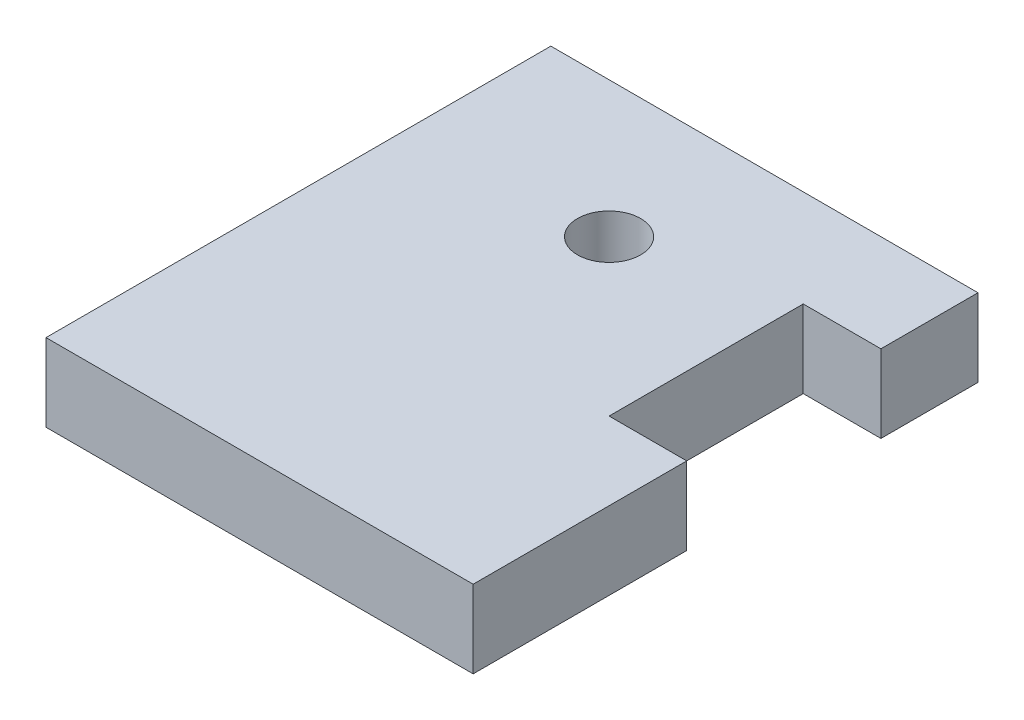
ISO-10303-21;
HEADER;
FILE_DESCRIPTION(('STEP AP214'),'2;1');
FILE_NAME('part.step','',(''),(''),'','','');
FILE_SCHEMA(('AUTOMOTIVE_DESIGN { 1 0 10303 214 1 1 1 1 }'));
ENDSEC;
DATA;
#1=APPLICATION_CONTEXT('core data for automotive mechanical design processes');
#2=APPLICATION_PROTOCOL_DEFINITION('international standard','automotive_design',2000,#1);
#3=PRODUCT_CONTEXT('',#1,'mechanical');
#4=PRODUCT('Part','Part','',(#3));
#5=PRODUCT_RELATED_PRODUCT_CATEGORY('part','',(#4));
#6=PRODUCT_DEFINITION_FORMATION('','',#4);
#7=PRODUCT_DEFINITION_CONTEXT('part definition',#1,'design');
#8=PRODUCT_DEFINITION('design','',#6,#7);
#9=PRODUCT_DEFINITION_SHAPE('','',#8);
#10=(LENGTH_UNIT() NAMED_UNIT(*) SI_UNIT(.MILLI.,.METRE.));
#11=(NAMED_UNIT(*) PLANE_ANGLE_UNIT() SI_UNIT($,.RADIAN.));
#12=(NAMED_UNIT(*) SI_UNIT($,.STERADIAN.) SOLID_ANGLE_UNIT());
#13=UNCERTAINTY_MEASURE_WITH_UNIT(LENGTH_MEASURE(1.E-05),#10,'distance_accuracy_value','');
#14=(GEOMETRIC_REPRESENTATION_CONTEXT(3) GLOBAL_UNCERTAINTY_ASSIGNED_CONTEXT((#13)) GLOBAL_UNIT_ASSIGNED_CONTEXT((#10,
#11,#12)) REPRESENTATION_CONTEXT('',''));
#15=CARTESIAN_POINT('',(0.,0.,0.));
#16=DIRECTION('',(0.,0.,1.));
#17=DIRECTION('',(1.,0.,0.));
#18=AXIS2_PLACEMENT_3D('',#15,#16,#17);
#19=CARTESIAN_POINT('',(0.,4.,0.));
#20=DIRECTION('',(0.,-1.,0.));
#21=DIRECTION('',(0.,0.,-1.));
#22=AXIS2_PLACEMENT_3D('',#19,#20,#21);
#23=PLANE('',#22);
#24=DIRECTION('',(0.,0.,1.));
#25=VECTOR('',#24,1.);
#26=CARTESIAN_POINT('',(0.,4.,0.));
#27=LINE('',#26,#25);
#28=CARTESIAN_POINT('',(0.,4.,-26.));
#29=VERTEX_POINT('',#28);
#30=CARTESIAN_POINT('',(0.,4.,0.));
#31=VERTEX_POINT('',#30);
#32=EDGE_CURVE('E170',#29,#31,#27,.T.);
#33=ORIENTED_EDGE('',*,*,#32,.T.);
#34=DIRECTION('',(1.,0.,0.));
#35=VECTOR('',#34,1.);
#36=CARTESIAN_POINT('',(0.,4.,0.));
#37=LINE('',#36,#35);
#38=CARTESIAN_POINT('',(22.,4.,0.));
#39=VERTEX_POINT('',#38);
#40=EDGE_CURVE('E106',#31,#39,#37,.T.);
#41=ORIENTED_EDGE('',*,*,#40,.T.);
#42=DIRECTION('',(0.,0.,-1.));
#43=VECTOR('',#42,1.);
#44=CARTESIAN_POINT('',(22.,4.,0.));
#45=LINE('',#44,#43);
#46=CARTESIAN_POINT('',(22.,4.,-11.));
#47=VERTEX_POINT('',#46);
#48=EDGE_CURVE('E191',#39,#47,#45,.T.);
#49=ORIENTED_EDGE('',*,*,#48,.T.);
#50=DIRECTION('',(-1.,0.,0.));
#51=VECTOR('',#50,1.);
#52=CARTESIAN_POINT('',(22.,4.,-11.));
#53=LINE('',#52,#51);
#54=CARTESIAN_POINT('',(18.,4.,-11.));
#55=VERTEX_POINT('',#54);
#56=EDGE_CURVE('E205',#47,#55,#53,.T.);
#57=ORIENTED_EDGE('',*,*,#56,.T.);
#58=DIRECTION('',(0.,0.,-1.));
#59=VECTOR('',#58,1.);
#60=CARTESIAN_POINT('',(18.,4.,-21.));
#61=LINE('',#60,#59);
#62=CARTESIAN_POINT('',(18.,4.,-21.));
#63=VERTEX_POINT('',#62);
#64=EDGE_CURVE('E125',#55,#63,#61,.T.);
#65=ORIENTED_EDGE('',*,*,#64,.T.);
#66=DIRECTION('',(1.,0.,0.));
#67=VECTOR('',#66,1.);
#68=CARTESIAN_POINT('',(22.,4.,-21.));
#69=LINE('',#68,#67);
#70=CARTESIAN_POINT('',(22.,4.,-21.));
#71=VERTEX_POINT('',#70);
#72=EDGE_CURVE('E119',#63,#71,#69,.T.);
#73=ORIENTED_EDGE('',*,*,#72,.T.);
#74=DIRECTION('',(0.,0.,-1.));
#75=VECTOR('',#74,1.);
#76=CARTESIAN_POINT('',(22.,4.,-21.));
#77=LINE('',#76,#75);
#78=CARTESIAN_POINT('',(22.,4.,-26.));
#79=VERTEX_POINT('',#78);
#80=EDGE_CURVE('E123',#71,#79,#77,.T.);
#81=ORIENTED_EDGE('',*,*,#80,.T.);
#82=DIRECTION('',(-1.,0.,0.));
#83=VECTOR('',#82,1.);
#84=CARTESIAN_POINT('',(0.,4.,-26.));
#85=LINE('',#84,#83);
#86=EDGE_CURVE('E63',#79,#29,#85,.T.);
#87=ORIENTED_EDGE('',*,*,#86,.T.);
#88=EDGE_LOOP('',(#33,#41,#49,#57,#65,#73,#81,#87));
#89=FACE_BOUND('',#88,.T.);
#90=CARTESIAN_POINT('',(10.,4.,-19.));
#91=DIRECTION('',(0.,1.,0.));
#92=DIRECTION('',(0.,0.,1.));
#93=AXIS2_PLACEMENT_3D('',#90,#91,#92);
#94=CIRCLE('',#93,1.625);
#95=CARTESIAN_POINT('',(10.,4.,-17.375));
#96=VERTEX_POINT('',#95);
#97=EDGE_CURVE('E152',#96,#96,#94,.T.);
#98=ORIENTED_EDGE('',*,*,#97,.F.);
#99=EDGE_LOOP('',(#98));
#100=FACE_BOUND('',#99,.T.);
#101=ADVANCED_FACE('F45',(#89,#100),#23,.F.);
#102=CARTESIAN_POINT('',(0.,0.,0.));
#103=DIRECTION('',(0.,-1.,0.));
#104=DIRECTION('',(0.,0.,-1.));
#105=AXIS2_PLACEMENT_3D('',#102,#103,#104);
#106=PLANE('',#105);
#107=DIRECTION('',(0.,0.,1.));
#108=VECTOR('',#107,1.);
#109=CARTESIAN_POINT('',(0.,0.,0.));
#110=LINE('',#109,#108);
#111=CARTESIAN_POINT('',(0.,0.,-26.));
#112=VERTEX_POINT('',#111);
#113=CARTESIAN_POINT('',(0.,0.,0.));
#114=VERTEX_POINT('',#113);
#115=EDGE_CURVE('E147',#112,#114,#110,.T.);
#116=ORIENTED_EDGE('',*,*,#115,.F.);
#117=DIRECTION('',(-1.,0.,0.));
#118=VECTOR('',#117,1.);
#119=CARTESIAN_POINT('',(0.,0.,-26.));
#120=LINE('',#119,#118);
#121=CARTESIAN_POINT('',(22.,0.,-26.));
#122=VERTEX_POINT('',#121);
#123=EDGE_CURVE('E98',#122,#112,#120,.T.);
#124=ORIENTED_EDGE('',*,*,#123,.F.);
#125=DIRECTION('',(0.,0.,-1.));
#126=VECTOR('',#125,1.);
#127=CARTESIAN_POINT('',(22.,0.,-21.));
#128=LINE('',#127,#126);
#129=CARTESIAN_POINT('',(22.,0.,-21.));
#130=VERTEX_POINT('',#129);
#131=EDGE_CURVE('E92',#130,#122,#128,.T.);
#132=ORIENTED_EDGE('',*,*,#131,.F.);
#133=DIRECTION('',(1.,0.,0.));
#134=VECTOR('',#133,1.);
#135=CARTESIAN_POINT('',(22.,0.,-21.));
#136=LINE('',#135,#134);
#137=CARTESIAN_POINT('',(18.,0.,-21.));
#138=VERTEX_POINT('',#137);
#139=EDGE_CURVE('E134',#138,#130,#136,.T.);
#140=ORIENTED_EDGE('',*,*,#139,.F.);
#141=DIRECTION('',(0.,0.,-1.));
#142=VECTOR('',#141,1.);
#143=CARTESIAN_POINT('',(18.,0.,-21.));
#144=LINE('',#143,#142);
#145=CARTESIAN_POINT('',(18.,0.,-11.));
#146=VERTEX_POINT('',#145);
#147=EDGE_CURVE('E161',#146,#138,#144,.T.);
#148=ORIENTED_EDGE('',*,*,#147,.F.);
#149=DIRECTION('',(-1.,0.,0.));
#150=VECTOR('',#149,1.);
#151=CARTESIAN_POINT('',(22.,0.,-11.));
#152=LINE('',#151,#150);
#153=CARTESIAN_POINT('',(22.,0.,-11.));
#154=VERTEX_POINT('',#153);
#155=EDGE_CURVE('E158',#154,#146,#152,.T.);
#156=ORIENTED_EDGE('',*,*,#155,.F.);
#157=DIRECTION('',(0.,0.,-1.));
#158=VECTOR('',#157,1.);
#159=CARTESIAN_POINT('',(22.,0.,0.));
#160=LINE('',#159,#158);
#161=CARTESIAN_POINT('',(22.,0.,0.));
#162=VERTEX_POINT('',#161);
#163=EDGE_CURVE('E155',#162,#154,#160,.T.);
#164=ORIENTED_EDGE('',*,*,#163,.F.);
#165=DIRECTION('',(1.,0.,0.));
#166=VECTOR('',#165,1.);
#167=CARTESIAN_POINT('',(0.,0.,0.));
#168=LINE('',#167,#166);
#169=EDGE_CURVE('E151',#114,#162,#168,.T.);
#170=ORIENTED_EDGE('',*,*,#169,.F.);
#171=EDGE_LOOP('',(#116,#124,#132,#140,#148,#156,#164,#170));
#172=FACE_BOUND('',#171,.T.);
#173=CARTESIAN_POINT('',(10.,0.,-19.));
#174=DIRECTION('',(0.,1.,0.));
#175=DIRECTION('',(0.,0.,1.));
#176=AXIS2_PLACEMENT_3D('',#173,#174,#175);
#177=CIRCLE('',#176,1.625);
#178=CARTESIAN_POINT('',(10.,0.,-17.375));
#179=VERTEX_POINT('',#178);
#180=EDGE_CURVE('E215',#179,#179,#177,.T.);
#181=ORIENTED_EDGE('',*,*,#180,.T.);
#182=EDGE_LOOP('',(#181));
#183=FACE_BOUND('',#182,.T.);
#184=ADVANCED_FACE('F195',(#172,#183),#106,.T.);
#185=CARTESIAN_POINT('',(0.,4.,0.));
#186=DIRECTION('',(1.,0.,0.));
#187=DIRECTION('',(0.,0.,-1.));
#188=AXIS2_PLACEMENT_3D('',#185,#186,#187);
#189=PLANE('',#188);
#190=ORIENTED_EDGE('',*,*,#115,.T.);
#191=DIRECTION('',(0.,-1.,0.));
#192=VECTOR('',#191,1.);
#193=CARTESIAN_POINT('',(0.,4.,0.));
#194=LINE('',#193,#192);
#195=EDGE_CURVE('E11',#31,#114,#194,.T.);
#196=ORIENTED_EDGE('',*,*,#195,.F.);
#197=ORIENTED_EDGE('',*,*,#32,.F.);
#198=DIRECTION('',(0.,-1.,0.));
#199=VECTOR('',#198,1.);
#200=CARTESIAN_POINT('',(0.,4.,-26.));
#201=LINE('',#200,#199);
#202=EDGE_CURVE('E143',#29,#112,#201,.T.);
#203=ORIENTED_EDGE('',*,*,#202,.T.);
#204=EDGE_LOOP('',(#190,#196,#197,#203));
#205=FACE_BOUND('',#204,.T.);
#206=ADVANCED_FACE('F47',(#205),#189,.F.);
#207=CARTESIAN_POINT('',(0.,4.,0.));
#208=DIRECTION('',(0.,0.,-1.));
#209=DIRECTION('',(-1.,0.,0.));
#210=AXIS2_PLACEMENT_3D('',#207,#208,#209);
#211=PLANE('',#210);
#212=ORIENTED_EDGE('',*,*,#169,.T.);
#213=DIRECTION('',(0.,-1.,0.));
#214=VECTOR('',#213,1.);
#215=CARTESIAN_POINT('',(22.,4.,0.));
#216=LINE('',#215,#214);
#217=EDGE_CURVE('E55',#39,#162,#216,.T.);
#218=ORIENTED_EDGE('',*,*,#217,.F.);
#219=ORIENTED_EDGE('',*,*,#40,.F.);
#220=ORIENTED_EDGE('',*,*,#195,.T.);
#221=EDGE_LOOP('',(#212,#218,#219,#220));
#222=FACE_BOUND('',#221,.T.);
#223=ADVANCED_FACE('F245',(#222),#211,.F.);
#224=CARTESIAN_POINT('',(22.,4.,0.));
#225=DIRECTION('',(-1.,0.,0.));
#226=DIRECTION('',(0.,0.,1.));
#227=AXIS2_PLACEMENT_3D('',#224,#225,#226);
#228=PLANE('',#227);
#229=ORIENTED_EDGE('',*,*,#163,.T.);
#230=DIRECTION('',(0.,-1.,0.));
#231=VECTOR('',#230,1.);
#232=CARTESIAN_POINT('',(22.,4.,-11.));
#233=LINE('',#232,#231);
#234=EDGE_CURVE('E181',#47,#154,#233,.T.);
#235=ORIENTED_EDGE('',*,*,#234,.F.);
#236=ORIENTED_EDGE('',*,*,#48,.F.);
#237=ORIENTED_EDGE('',*,*,#217,.T.);
#238=EDGE_LOOP('',(#229,#235,#236,#237));
#239=FACE_BOUND('',#238,.T.);
#240=ADVANCED_FACE('F189',(#239),#228,.F.);
#241=CARTESIAN_POINT('',(22.,4.,-11.));
#242=DIRECTION('',(0.,0.,1.));
#243=DIRECTION('',(1.,0.,0.));
#244=AXIS2_PLACEMENT_3D('',#241,#242,#243);
#245=PLANE('',#244);
#246=ORIENTED_EDGE('',*,*,#155,.T.);
#247=DIRECTION('',(0.,-1.,0.));
#248=VECTOR('',#247,1.);
#249=CARTESIAN_POINT('',(18.,4.,-11.));
#250=LINE('',#249,#248);
#251=EDGE_CURVE('E177',#55,#146,#250,.T.);
#252=ORIENTED_EDGE('',*,*,#251,.F.);
#253=ORIENTED_EDGE('',*,*,#56,.F.);
#254=ORIENTED_EDGE('',*,*,#234,.T.);
#255=EDGE_LOOP('',(#246,#252,#253,#254));
#256=FACE_BOUND('',#255,.T.);
#257=ADVANCED_FACE('F200',(#256),#245,.F.);
#258=CARTESIAN_POINT('',(18.,4.,-21.));
#259=DIRECTION('',(-1.,0.,0.));
#260=DIRECTION('',(0.,0.,1.));
#261=AXIS2_PLACEMENT_3D('',#258,#259,#260);
#262=PLANE('',#261);
#263=ORIENTED_EDGE('',*,*,#147,.T.);
#264=DIRECTION('',(0.,-1.,0.));
#265=VECTOR('',#264,1.);
#266=CARTESIAN_POINT('',(18.,4.,-21.));
#267=LINE('',#266,#265);
#268=EDGE_CURVE('E136',#63,#138,#267,.T.);
#269=ORIENTED_EDGE('',*,*,#268,.F.);
#270=ORIENTED_EDGE('',*,*,#64,.F.);
#271=ORIENTED_EDGE('',*,*,#251,.T.);
#272=EDGE_LOOP('',(#263,#269,#270,#271));
#273=FACE_BOUND('',#272,.T.);
#274=ADVANCED_FACE('F203',(#273),#262,.F.);
#275=CARTESIAN_POINT('',(22.,4.,-21.));
#276=DIRECTION('',(0.,0.,-1.));
#277=DIRECTION('',(-1.,0.,0.));
#278=AXIS2_PLACEMENT_3D('',#275,#276,#277);
#279=PLANE('',#278);
#280=ORIENTED_EDGE('',*,*,#139,.T.);
#281=DIRECTION('',(0.,-1.,0.));
#282=VECTOR('',#281,1.);
#283=CARTESIAN_POINT('',(22.,4.,-21.));
#284=LINE('',#283,#282);
#285=EDGE_CURVE('E131',#71,#130,#284,.T.);
#286=ORIENTED_EDGE('',*,*,#285,.F.);
#287=ORIENTED_EDGE('',*,*,#72,.F.);
#288=ORIENTED_EDGE('',*,*,#268,.T.);
#289=EDGE_LOOP('',(#280,#286,#287,#288));
#290=FACE_BOUND('',#289,.T.);
#291=ADVANCED_FACE('F132',(#290),#279,.F.);
#292=CARTESIAN_POINT('',(22.,4.,-21.));
#293=DIRECTION('',(-1.,0.,0.));
#294=DIRECTION('',(0.,0.,1.));
#295=AXIS2_PLACEMENT_3D('',#292,#293,#294);
#296=PLANE('',#295);
#297=ORIENTED_EDGE('',*,*,#131,.T.);
#298=DIRECTION('',(0.,-1.,0.));
#299=VECTOR('',#298,1.);
#300=CARTESIAN_POINT('',(22.,4.,-26.));
#301=LINE('',#300,#299);
#302=EDGE_CURVE('E137',#79,#122,#301,.T.);
#303=ORIENTED_EDGE('',*,*,#302,.F.);
#304=ORIENTED_EDGE('',*,*,#80,.F.);
#305=ORIENTED_EDGE('',*,*,#285,.T.);
#306=EDGE_LOOP('',(#297,#303,#304,#305));
#307=FACE_BOUND('',#306,.T.);
#308=ADVANCED_FACE('F139',(#307),#296,.F.);
#309=CARTESIAN_POINT('',(0.,4.,-26.));
#310=DIRECTION('',(0.,0.,1.));
#311=DIRECTION('',(1.,0.,0.));
#312=AXIS2_PLACEMENT_3D('',#309,#310,#311);
#313=PLANE('',#312);
#314=ORIENTED_EDGE('',*,*,#123,.T.);
#315=ORIENTED_EDGE('',*,*,#202,.F.);
#316=ORIENTED_EDGE('',*,*,#86,.F.);
#317=ORIENTED_EDGE('',*,*,#302,.T.);
#318=EDGE_LOOP('',(#314,#315,#316,#317));
#319=FACE_BOUND('',#318,.T.);
#320=ADVANCED_FACE('F233',(#319),#313,.F.);
#321=CARTESIAN_POINT('',(10.,4.,-19.));
#322=DIRECTION('',(0.,-1.,0.));
#323=DIRECTION('',(0.,0.,-1.));
#324=AXIS2_PLACEMENT_3D('',#321,#322,#323);
#325=CYLINDRICAL_SURFACE('',#324,1.625);
#326=ORIENTED_EDGE('',*,*,#97,.T.);
#327=EDGE_LOOP('',(#326));
#328=FACE_BOUND('',#327,.T.);
#329=ORIENTED_EDGE('',*,*,#180,.F.);
#330=EDGE_LOOP('',(#329));
#331=FACE_BOUND('',#330,.T.);
#332=ADVANCED_FACE('F223',(#328,#331),#325,.F.);
#333=CLOSED_SHELL('',(#101,#184,#206,#223,#240,#257,#274,#291,#308,#320,#332));
#334=MANIFOLD_SOLID_BREP('B2',#333);
#335=ADVANCED_BREP_SHAPE_REPRESENTATION('',(#18,#334),#14);
#336=SHAPE_DEFINITION_REPRESENTATION(#9,#335);
ENDSEC;
END-ISO-10303-21;
